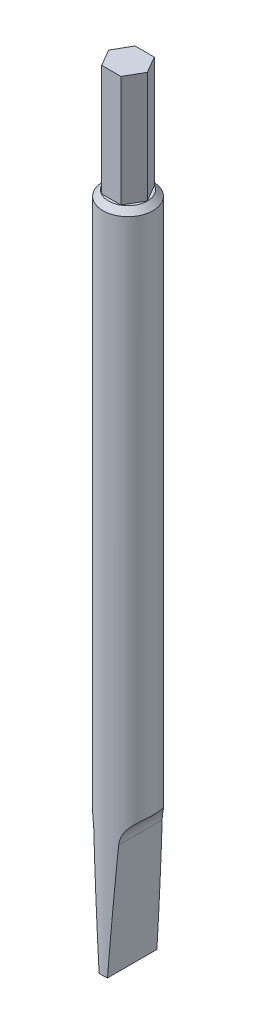
ISO-10303-21;
HEADER;
FILE_DESCRIPTION(('STEP AP214'),'2;1');
FILE_NAME('part.step','',(''),(''),'','','');
FILE_SCHEMA(('AUTOMOTIVE_DESIGN { 1 0 10303 214 1 1 1 1 }'));
ENDSEC;
DATA;
#1=APPLICATION_CONTEXT('core data for automotive mechanical design processes');
#2=APPLICATION_PROTOCOL_DEFINITION('international standard','automotive_design',2000,#1);
#3=PRODUCT_CONTEXT('',#1,'mechanical');
#4=PRODUCT('Part','Part','',(#3));
#5=PRODUCT_RELATED_PRODUCT_CATEGORY('part','',(#4));
#6=PRODUCT_DEFINITION_FORMATION('','',#4);
#7=PRODUCT_DEFINITION_CONTEXT('part definition',#1,'design');
#8=PRODUCT_DEFINITION('design','',#6,#7);
#9=PRODUCT_DEFINITION_SHAPE('','',#8);
#10=(LENGTH_UNIT() NAMED_UNIT(*) SI_UNIT(.MILLI.,.METRE.));
#11=(NAMED_UNIT(*) PLANE_ANGLE_UNIT() SI_UNIT($,.RADIAN.));
#12=(NAMED_UNIT(*) SI_UNIT($,.STERADIAN.) SOLID_ANGLE_UNIT());
#13=UNCERTAINTY_MEASURE_WITH_UNIT(LENGTH_MEASURE(1.E-05),#10,'distance_accuracy_value','');
#14=(GEOMETRIC_REPRESENTATION_CONTEXT(3) GLOBAL_UNCERTAINTY_ASSIGNED_CONTEXT((#13)) GLOBAL_UNIT_ASSIGNED_CONTEXT((#10,
#11,#12)) REPRESENTATION_CONTEXT('',''));
#15=CARTESIAN_POINT('',(0.,0.,0.));
#16=DIRECTION('',(0.,0.,1.));
#17=DIRECTION('',(1.,0.,0.));
#18=AXIS2_PLACEMENT_3D('',#15,#16,#17);
#19=CARTESIAN_POINT('',(0.,120.,0.));
#20=DIRECTION('',(0.,-1.,0.));
#21=DIRECTION('',(0.,0.,-1.));
#22=AXIS2_PLACEMENT_3D('',#19,#20,#21);
#23=CYLINDRICAL_SURFACE('',#22,4.5);
#24=CARTESIAN_POINT('',(0.,119.,0.));
#25=DIRECTION('',(0.,1.,0.));
#26=DIRECTION('',(0.,0.,1.));
#27=AXIS2_PLACEMENT_3D('',#24,#25,#26);
#28=CIRCLE('',#27,4.5);
#29=CARTESIAN_POINT('',(0.,119.,4.5));
#30=VERTEX_POINT('',#29);
#31=EDGE_CURVE('E195',#30,#30,#28,.F.);
#32=ORIENTED_EDGE('',*,*,#31,.T.);
#33=EDGE_LOOP('',(#32));
#34=FACE_BOUND('',#33,.T.);
#35=CARTESIAN_POINT('',(4.5,25.,0.));
#36=CARTESIAN_POINT('',(4.49999959992725,25.0000002197825,-0.103069362665923));
#37=CARTESIAN_POINT('',(4.4964547687701,24.9977117883437,-0.206146526435712));
#38=CARTESIAN_POINT('',(4.48231641289706,24.9885094011417,-0.411646375812205));
#39=CARTESIAN_POINT('',(4.471720103098,24.9815936177332,-0.514068786670952));
#40=CARTESIAN_POINT('',(4.44359339520637,24.9629816995036,-0.717671951158926));
#41=CARTESIAN_POINT('',(4.42605305791933,24.9512787118113,-0.818850709741652));
#42=CARTESIAN_POINT('',(4.38426815019585,24.9228626325524,-1.01914825963944));
#43=CARTESIAN_POINT('',(4.36002062815834,24.9061473349679,-1.11826612333105));
#44=CARTESIAN_POINT('',(4.30514220860286,24.8673923480396,-1.31380152114607));
#45=CARTESIAN_POINT('',(4.27450302221004,24.8453457389448,-1.41021536260286));
#46=CARTESIAN_POINT('',(4.20736148164584,24.7956160536421,-1.59943155048248));
#47=CARTESIAN_POINT('',(4.17086194222075,24.767935681649,-1.69223560424763));
#48=CARTESIAN_POINT('',(4.09264183349527,24.7066046140397,-1.87350490130667));
#49=CARTESIAN_POINT('',(4.05092440102978,24.6729575004078,-1.96197270731234));
#50=CARTESIAN_POINT('',(3.96303382328751,24.5993661271413,-2.13393666412593));
#51=CARTESIAN_POINT('',(3.91686087963601,24.5594221524068,-2.21743303962979));
#52=CARTESIAN_POINT('',(3.82239737029962,24.4742608955362,-2.37646391449525));
#53=CARTESIAN_POINT('',(3.77420859180666,24.4292325735824,-2.45216008078264));
#54=CARTESIAN_POINT('',(3.67546318239439,24.3328732662188,-2.59782907350368));
#55=CARTESIAN_POINT('',(3.62490574033656,24.2815401118433,-2.66779991646167));
#56=CARTESIAN_POINT('',(3.52252047999784,24.1726173143242,-2.80159661560525));
#57=CARTESIAN_POINT('',(3.47069333419624,24.1150309299113,-2.86542564006081));
#58=CARTESIAN_POINT('',(3.36681443417587,23.9937009585887,-2.98679509415646));
#59=CARTESIAN_POINT('',(3.31476260433588,23.9299551141531,-3.04433320149472));
#60=CARTESIAN_POINT('',(3.21343160285213,23.7990606139254,-3.15104312227083));
#61=CARTESIAN_POINT('',(3.16412086929093,23.7321233651335,-3.20044482157965));
#62=CARTESIAN_POINT('',(3.06719777608159,23.5931418020546,-3.29344984525706));
#63=CARTESIAN_POINT('',(3.01958602561713,23.5210956830591,-3.33705110482005));
#64=CARTESIAN_POINT('',(2.92690525303493,23.3723530558154,-3.41863105708231));
#65=CARTESIAN_POINT('',(2.8818360138848,23.2956569456601,-3.45661023014176));
#66=CARTESIAN_POINT('',(2.79493487388616,23.1380591403335,-3.52724775030432));
#67=CARTESIAN_POINT('',(2.75310417130193,23.0571559068526,-3.55990413285861));
#68=CARTESIAN_POINT('',(2.67102432402597,22.8869517854436,-3.62193674409111));
#69=CARTESIAN_POINT('',(2.63100129171946,22.7974350930536,-3.65101984206153));
#70=CARTESIAN_POINT('',(2.55582789107762,22.6148580591291,-3.7040330490454));
#71=CARTESIAN_POINT('',(2.52067963573703,22.5217962030663,-3.72796092597584));
#72=CARTESIAN_POINT('',(2.45572257370377,22.3327438863957,-3.77106708250035));
#73=CARTESIAN_POINT('',(2.42591450554497,22.2367530228588,-3.79024470528685));
#74=CARTESIAN_POINT('',(2.371985126562,22.0424260431399,-3.82422567164936));
#75=CARTESIAN_POINT('',(2.34786427600567,21.9440897378494,-3.83902866120985));
#76=CARTESIAN_POINT('',(2.30317872247504,21.7344392115953,-3.86602211295916));
#77=CARTESIAN_POINT('',(2.2833212295114,21.6229114451606,-3.87773008241695));
#78=CARTESIAN_POINT('',(2.25119824829117,21.3983776429027,-3.89646653880564));
#79=CARTESIAN_POINT('',(2.23893326853474,21.2853715085848,-3.90349471231479));
#80=CARTESIAN_POINT('',(2.2221278006484,21.0585475614571,-3.9130860068678));
#81=CARTESIAN_POINT('',(2.21759074245094,20.9447294107383,-3.91564714529122));
#82=CARTESIAN_POINT('',(2.21629990204796,20.7170357567943,-3.9163777367708));
#83=CARTESIAN_POINT('',(2.21954621021972,20.6031602529186,-3.9145471388319));
#84=CARTESIAN_POINT('',(2.23426894804853,20.3683979068717,-3.90616454068513));
#85=CARTESIAN_POINT('',(2.24628494335067,20.247555384675,-3.89930286209516));
#86=CARTESIAN_POINT('',(2.2789980246609,20.0074652157646,-3.88027386542346));
#87=CARTESIAN_POINT('',(2.29969560002872,19.8882176593464,-3.86810624825724));
#88=CARTESIAN_POINT('',(2.34949827973738,19.6522008537151,-3.83805987169653));
#89=CARTESIAN_POINT('',(2.37860449941632,19.5354319354802,-3.82018035463177));
#90=CARTESIAN_POINT('',(2.44479279662183,19.3053270220365,-3.77816410484999));
#91=CARTESIAN_POINT('',(2.48187454180607,19.1919908840073,-3.75402763285339));
#92=CARTESIAN_POINT('',(2.56264818514399,18.9717596235569,-3.6993468607103));
#93=CARTESIAN_POINT('',(2.60620662438002,18.8647845641702,-3.66892797534513));
#94=CARTESIAN_POINT('',(2.69961396127203,18.6560306378224,-3.60075344227851));
#95=CARTESIAN_POINT('',(2.74946286078548,18.5542517723957,-3.56299779241061));
#96=CARTESIAN_POINT('',(2.85434660668727,18.3569550826022,-3.47953864440165));
#97=CARTESIAN_POINT('',(2.90937580002357,18.2614306217757,-3.43384376500395));
#98=CARTESIAN_POINT('',(3.02335500686727,18.0774413157122,-3.3339258219214));
#99=CARTESIAN_POINT('',(3.08230445292271,17.9889754528119,-3.27970399095881));
#100=CARTESIAN_POINT('',(3.19631152006896,17.8286907859084,-3.16847855957585));
#101=CARTESIAN_POINT('',(3.25113633589682,17.7560975257227,-3.11235065569654));
#102=CARTESIAN_POINT('',(3.36143714975015,17.6176556877435,-2.99288250161539));
#103=CARTESIAN_POINT('',(3.41691308679794,17.5518064838969,-2.92954292203083));
#104=CARTESIAN_POINT('',(3.52719038039944,17.4271575897072,-2.79578912411175));
#105=CARTESIAN_POINT('',(3.58199193718975,17.3683557592146,-2.72537706555113));
#106=CARTESIAN_POINT('',(3.68963122609968,17.2578891525056,-2.57778204696872));
#107=CARTESIAN_POINT('',(3.74246904856555,17.2062240476495,-2.50059939899425));
#108=CARTESIAN_POINT('',(3.84035365857382,17.1142819735882,-2.34717040047752));
#109=CARTESIAN_POINT('',(3.88567430027106,17.0733993624697,-2.27146003882036));
#110=CARTESIAN_POINT('',(3.972848583273,16.9973221337187,-2.11529480833383));
#111=CARTESIAN_POINT('',(4.0147011181452,16.962129327929,-2.03483843928944));
#112=CARTESIAN_POINT('',(4.09418737623395,16.8972238494773,-1.86976491901818));
#113=CARTESIAN_POINT('',(4.13182186181072,16.8675101858996,-1.78514852365475));
#114=CARTESIAN_POINT('',(4.20228834208165,16.813269199536,-1.6122927357632));
#115=CARTESIAN_POINT('',(4.23511849285271,16.7887438664514,-1.52405196874021));
#116=CARTESIAN_POINT('',(4.29601076944073,16.7442109434331,-1.34297373485953));
#117=CARTESIAN_POINT('',(4.32397708815631,16.7242920251056,-1.25008227473878));
#118=CARTESIAN_POINT('',(4.37402031006423,16.6892514817669,-1.0618089991616));
#119=CARTESIAN_POINT('',(4.39609519434713,16.6741315009471,-0.966426342269647));
#120=CARTESIAN_POINT('',(4.43405247530582,16.6484511370493,-0.773829999084722));
#121=CARTESIAN_POINT('',(4.44993460419531,16.6378909511433,-0.676616233801714));
#122=CARTESIAN_POINT('',(4.47530827628885,16.6211440963123,-0.480984528317151));
#123=CARTESIAN_POINT('',(4.48479958348029,16.6149575889066,-0.382566543780505));
#124=CARTESIAN_POINT('',(4.49761588849471,16.6066227549277,-0.179786485951482));
#125=CARTESIAN_POINT('',(4.50057852937734,16.6047116422493,-0.0753915311064947));
#126=CARTESIAN_POINT('',(4.49923517876634,16.6055812949774,0.133298519520398));
#127=CARTESIAN_POINT('',(4.49493142161667,16.6083606181221,0.237593636135413));
#128=CARTESIAN_POINT('',(4.47911096934641,16.6186702343469,0.445460657929826));
#129=CARTESIAN_POINT('',(4.46759016111325,16.6262032366426,0.549032116626802));
#130=CARTESIAN_POINT('',(4.43749130505876,16.6461735855517,0.754625845668829));
#131=CARTESIAN_POINT('',(4.41891599361709,16.6586090306217,0.856648700766103));
#132=CARTESIAN_POINT('',(4.3746424375622,16.6888464556667,1.05994525916554));
#133=CARTESIAN_POINT('',(4.34884294710629,16.7067250567804,1.16118558801716));
#134=CARTESIAN_POINT('',(4.29065419495021,16.7480933097216,1.36053785732147));
#135=CARTESIAN_POINT('',(4.2582675382252,16.7715807441048,1.45865101676466));
#136=CARTESIAN_POINT('',(4.18745032243508,16.8245285691193,1.65098719675716));
#137=CARTESIAN_POINT('',(4.14902108003093,16.8539876589484,1.74521105913875));
#138=CARTESIAN_POINT('',(4.06681991059838,16.9192496912752,1.92901767855518));
#139=CARTESIAN_POINT('',(4.02304826739616,16.9550522968059,2.01860068178547));
#140=CARTESIAN_POINT('',(3.93288020236327,17.0317602466168,2.18891848545425));
#141=CARTESIAN_POINT('',(3.88665900252031,17.0724039420428,2.2698639349504));
#142=CARTESIAN_POINT('',(3.79099688495646,17.1600665291389,2.42626213602189));
#143=CARTESIAN_POINT('',(3.74155488053636,17.2070875783783,2.50171301535398));
#144=CARTESIAN_POINT('',(3.64053705577675,17.3075542985464,2.64656035017943));
#145=CARTESIAN_POINT('',(3.58896292015322,17.3609949582933,2.71596145605909));
#146=CARTESIAN_POINT('',(3.48473261347848,17.474313349933,2.84846407594613));
#147=CARTESIAN_POINT('',(3.43207606161792,17.5341933797583,2.91156332549745));
#148=CARTESIAN_POINT('',(3.32934266894438,17.6571844484924,3.02840560019249));
#149=CARTESIAN_POINT('',(3.27926236791103,17.7200059188053,3.08245105089513));
#150=CARTESIAN_POINT('',(3.18010490670166,17.8510485347542,3.18465150256468));
#151=CARTESIAN_POINT('',(3.13102810746447,17.919271581688,3.23280441410219));
#152=CARTESIAN_POINT('',(3.03479657993718,18.0607153565325,3.32330769017292));
#153=CARTESIAN_POINT('',(2.98764162398131,18.1339354897128,3.36565874341879));
#154=CARTESIAN_POINT('',(2.89603178121556,18.2849640418223,3.44480286097595));
#155=CARTESIAN_POINT('',(2.85157789787664,18.3627741450609,3.48159386714152));
#156=CARTESIAN_POINT('',(2.76448915105963,18.5254453724791,3.55117195899449));
#157=CARTESIAN_POINT('',(2.7219835871284,18.6104611461558,3.58375903483153));
#158=CARTESIAN_POINT('',(2.64126927684473,18.7843466310612,3.64365535207884));
#159=CARTESIAN_POINT('',(2.60306237477838,18.8732179739868,3.67096233171438));
#160=CARTESIAN_POINT('',(2.53147847510343,19.054222105154,3.72068770710746));
#161=CARTESIAN_POINT('',(2.49810205171687,19.1463552795277,3.74310552182694));
#162=CARTESIAN_POINT('',(2.43658605030678,19.3333184956038,3.78343773102366));
#163=CARTESIAN_POINT('',(2.40844692584047,19.4281487700598,3.80135173551188));
#164=CARTESIAN_POINT('',(2.35490834516223,19.6305729144311,3.83477673953591));
#165=CARTESIAN_POINT('',(2.33015598307192,19.7384185508764,3.84980292215984));
#166=CARTESIAN_POINT('',(2.28779373167278,19.9560506990995,3.87512687895667));
#167=CARTESIAN_POINT('',(2.27018429768784,20.0658373341405,3.88542435170484));
#168=CARTESIAN_POINT('',(2.24229877350844,20.2867078146914,3.90158383710492));
#169=CARTESIAN_POINT('',(2.23202579654068,20.3977921906002,3.90744396683314));
#170=CARTESIAN_POINT('',(2.2189329942526,20.620541373334,3.91489365328983));
#171=CARTESIAN_POINT('',(2.21611336057867,20.7322061950101,3.91648310020707));
#172=CARTESIAN_POINT('',(2.21803256126056,20.9645298748976,3.91539728764433));
#173=CARTESIAN_POINT('',(2.2234039770138,21.0851825167372,3.9123651171464));
#174=CARTESIAN_POINT('',(2.24283296683402,21.3255598032933,3.9012593658522));
#175=CARTESIAN_POINT('',(2.25689107423433,21.4452843905735,3.89318547551113));
#176=CARTESIAN_POINT('',(2.29352339709321,21.6829806364795,3.87171813877961));
#177=CARTESIAN_POINT('',(2.31610006161069,21.8009517808485,3.85832316253482));
#178=CARTESIAN_POINT('',(2.36946433582885,22.0342166902461,3.82578291934212));
#179=CARTESIAN_POINT('',(2.40025175186695,22.1495105183533,3.8066377880187));
#180=CARTESIAN_POINT('',(2.46955006626093,22.3764107111197,3.76204969756656));
#181=CARTESIAN_POINT('',(2.50805494617877,22.488019870747,3.73661164235412));
#182=CARTESIAN_POINT('',(2.59215244599265,22.7066840292833,3.6787699767713));
#183=CARTESIAN_POINT('',(2.63774518011544,22.8137389547615,3.64636625414009));
#184=CARTESIAN_POINT('',(2.73508968205904,23.0222075358242,3.57392775310544));
#185=CARTESIAN_POINT('',(2.78683582239651,23.1236262232294,3.53389992732547));
#186=CARTESIAN_POINT('',(2.89537198598165,23.3199368856706,3.4455351808607));
#187=CARTESIAN_POINT('',(2.95216132870909,23.4148297382334,3.39719938041741));
#188=CARTESIAN_POINT('',(3.06401792825743,23.5888613984574,3.29650209378133));
#189=CARTESIAN_POINT('',(3.11877030223411,23.6686477820911,3.24490917812634));
#190=CARTESIAN_POINT('',(3.23002452467415,23.8214891985089,3.13418199914556));
#191=CARTESIAN_POINT('',(3.28652626330706,23.8945446527409,3.07504820853485));
#192=CARTESIAN_POINT('',(3.39987656193094,24.0334302131299,2.94923741426076));
#193=CARTESIAN_POINT('',(3.45672486934676,24.0992650403017,2.88256539788781));
#194=CARTESIAN_POINT('',(3.56938382220596,24.2234953095027,2.74182760560056));
#195=CARTESIAN_POINT('',(3.62519454533971,24.2818913104546,2.66776238592769));
#196=CARTESIAN_POINT('',(3.72868896674217,24.3854775849313,2.52073395305748));
#197=CARTESIAN_POINT('',(3.77661337954485,24.4314098963345,2.44846069234197));
#198=CARTESIAN_POINT('',(3.86959754692028,24.5173527843578,2.29869197722838));
#199=CARTESIAN_POINT('',(3.91465631003365,24.5573613177553,2.22119473433099));
#200=CARTESIAN_POINT('',(4.00106138832014,24.6316232898957,2.06149289386532));
#201=CARTESIAN_POINT('',(4.04240685362276,24.6658754127114,1.97928722568458));
#202=CARTESIAN_POINT('',(4.1206688840926,24.7288766689265,1.81072524154589));
#203=CARTESIAN_POINT('',(4.15758383993656,24.7576238049575,1.72436743323572));
#204=CARTESIAN_POINT('',(4.22635764730017,24.8098777553719,1.54817364969427));
#205=CARTESIAN_POINT('',(4.25821859353252,24.8333867424307,1.45833913474397));
#206=CARTESIAN_POINT('',(4.3164428873989,24.8754834818024,1.27573849578303));
#207=CARTESIAN_POINT('',(4.34280376836452,24.8940690270541,1.1829710778091));
#208=CARTESIAN_POINT('',(4.38960691636663,24.9265486522779,0.995331853000653));
#209=CARTESIAN_POINT('',(4.41005951223732,24.9404509266789,0.900464034630373));
#210=CARTESIAN_POINT('',(4.44484740959923,24.9638359869689,0.709077330364528));
#211=CARTESIAN_POINT('',(4.4591828016397,24.9733188382763,0.612558468930346));
#212=CARTESIAN_POINT('',(4.48021987851915,24.9871470558806,0.430138417632385));
#213=CARTESIAN_POINT('',(4.48763162485991,24.9919726718831,0.344354315724885));
#214=CARTESIAN_POINT('',(4.49752188615395,24.9983990737922,0.172381964724905));
#215=CARTESIAN_POINT('',(4.50000033456842,24.9999998162027,0.0861937101970542));
#216=CARTESIAN_POINT('',(4.5,25.,0.));
#217=B_SPLINE_CURVE_WITH_KNOTS('',3,(#35,#36,#37,#38,#39,#40,#41,#42,#43,#44,#45,#46,#47,#48,
#49,#50,#51,#52,#53,#54,#55,#56,#57,#58,#59,#60,#61,#62,#63,#64,#65,#66,#67,#68,#69,#70,#71,#72,
#73,#74,#75,#76,#77,#78,#79,#80,#81,#82,#83,#84,#85,#86,#87,#88,#89,#90,#91,#92,#93,#94,#95,#96,
#97,#98,#99,#100,#101,#102,#103,#104,#105,#106,#107,#108,#109,#110,#111,#112,#113,#114,#115,
#116,#117,#118,#119,#120,#121,#122,#123,#124,#125,#126,#127,#128,#129,#130,#131,#132,#133,#134,
#135,#136,#137,#138,#139,#140,#141,#142,#143,#144,#145,#146,#147,#148,#149,#150,#151,#152,#153,
#154,#155,#156,#157,#158,#159,#160,#161,#162,#163,#164,#165,#166,#167,#168,#169,#170,#171,#172,
#173,#174,#175,#176,#177,#178,#179,#180,#181,#182,#183,#184,#185,#186,#187,#188,#189,#190,#191,
#192,#193,#194,#195,#196,#197,#198,#199,#200,#201,#202,#203,#204,#205,#206,#207,#208,#209,#210,
#211,#212,#213,#214,#215,#216),.UNSPECIFIED.,.T.,.F.,(4,2,2,2,2,2,2,2,2,2,2,2,2,2,2,2,2,2,2,2,2,
2,2,2,2,2,2,2,2,2,2,2,2,2,2,2,2,2,2,2,2,2,2,2,2,2,2,2,2,2,2,2,2,2,2,2,2,2,2,2,2,2,2,2,2,2,2,2,2,
2,2,2,2,2,2,2,2,2,2,2,2,2,2,2,2,2,2,2,2,2,4),(0.,0.309135188173822,0.61839254627253,
0.928094163427286,1.23793228701997,1.54817474269632,1.85826863124844,2.16817698902182,
2.47807132908082,2.77887922218734,3.07979088952104,3.38054648928678,3.6814127412398,
3.97121245448043,4.26111505440181,4.55099287026079,4.84097743386245,5.147493657908,
5.45414233035836,5.76083337883226,6.06754923936998,6.40883423722361,6.75014208978928,
7.09160138774855,7.43306465061267,7.79752512639503,8.16200614869652,8.52653553864863,
8.89104974150326,9.2488899118394,9.60673018784066,9.96418439614748,10.3215869755265,
10.6418214865779,10.9620262431482,11.2821335120663,11.6022260354161,11.893632150727,
12.1851308784472,12.4765768361295,12.7681343602163,13.0649078374311,13.3617828844209,
13.6586707674181,13.9555696138638,14.2685711441521,14.5814764471602,14.894560242336,
15.2075227188972,15.5251120490118,15.842576027905,16.159970927982,16.4773489731259,
16.7820217341375,17.0867978295395,17.3913375424989,17.6959862954218,17.9861303984156,
18.2763770870127,18.5665892918135,18.856908661828,19.1580344208093,19.4592888852298,
19.7605791318425,20.0618954584726,20.3965333004211,20.7311924704109,21.0659935688243,
21.4008032758306,21.762809667809,22.1248382879576,22.4869710696219,22.84909531061,
23.2109382414062,23.5727870042114,23.9343073537813,24.2957789943863,24.6243013724941,
24.9528031666233,25.2810888818576,25.6093499164933,25.903392228367,26.1975357258831,
26.4917463740058,26.7860635688321,27.080258458796,27.3745850069726,27.6683938572329,
27.9621983582687,28.2207150382293,28.4792352049594),.UNSPECIFIED.);
#218=CARTESIAN_POINT('',(2.22904475760722,21.1513254572824,3.90913794443018));
#219=VERTEX_POINT('',#218);
#220=CARTESIAN_POINT('',(2.22904475760722,21.1513254572824,-3.90913794443018));
#221=VERTEX_POINT('',#220);
#222=EDGE_CURVE('E11',#219,#221,#217,.T.);
#223=ORIENTED_EDGE('',*,*,#222,.T.);
#224=CARTESIAN_POINT('',(0.,-10.7254996925351,0.));
#225=DIRECTION('',(-0.997564050259825,0.0697564737441181,0.));
#226=DIRECTION('',(-0.0697564737441181,-0.997564050259825,0.));
#227=AXIS2_PLACEMENT_3D('',#224,#225,#226);
#228=ELLIPSE('',#227,64.5101416179232,4.5);
#229=CARTESIAN_POINT('',(0.75,0.,-4.43705983732471));
#230=VERTEX_POINT('',#229);
#231=EDGE_CURVE('E135',#221,#230,#228,.T.);
#232=ORIENTED_EDGE('',*,*,#231,.T.);
#233=CARTESIAN_POINT('',(0.,0.,0.));
#234=DIRECTION('',(0.,1.,0.));
#235=DIRECTION('',(0.,0.,1.));
#236=AXIS2_PLACEMENT_3D('',#233,#234,#235);
#237=CIRCLE('',#236,4.5);
#238=CARTESIAN_POINT('',(-0.75,0.,-4.43705983732471));
#239=VERTEX_POINT('',#238);
#240=EDGE_CURVE('E134',#230,#239,#237,.T.);
#241=ORIENTED_EDGE('',*,*,#240,.T.);
#242=CARTESIAN_POINT('',(0.,-10.7254996925351,0.));
#243=DIRECTION('',(0.997564050259825,0.0697564737441181,0.));
#244=DIRECTION('',(0.0697564737441181,-0.997564050259825,0.));
#245=AXIS2_PLACEMENT_3D('',#242,#243,#244);
#246=ELLIPSE('',#245,64.5101416179232,4.5);
#247=CARTESIAN_POINT('',(-2.22904475760722,21.1513254572824,-3.90913794443018));
#248=VERTEX_POINT('',#247);
#249=EDGE_CURVE('E59',#239,#248,#246,.T.);
#250=ORIENTED_EDGE('',*,*,#249,.T.);
#251=CARTESIAN_POINT('',(-2.21686500890634,20.8025430885618,-3.91605790716719));
#252=CARTESIAN_POINT('',(-2.21686541766622,20.9197791961003,-3.91605827017623));
#253=CARTESIAN_POINT('',(-2.2209925846671,21.0370230483852,-3.91373006399613));
#254=CARTESIAN_POINT('',(-2.23745885695756,21.2707845035446,-3.90433943824787));
#255=CARTESIAN_POINT('',(-2.24980110333789,21.3873018114126,-3.89727520782157));
#256=CARTESIAN_POINT('',(-2.2825857573446,21.6189994556137,-3.87816493182726));
#257=CARTESIAN_POINT('',(-2.30304281179426,21.7341769846356,-3.86610987634112));
#258=CARTESIAN_POINT('',(-2.35179738039968,21.9621561360079,-3.83664695386146));
#259=CARTESIAN_POINT('',(-2.38009410662444,22.0749579959011,-3.81923962478216));
#260=CARTESIAN_POINT('',(-2.4442296688225,22.2976743449524,-3.77851663077295));
#261=CARTESIAN_POINT('',(-2.48008995910786,22.4075795983199,-3.75518411961044));
#262=CARTESIAN_POINT('',(-2.55874359161576,22.6232795386732,-3.70203764512981));
#263=CARTESIAN_POINT('',(-2.60153716653428,22.7290740875471,-3.6722234642614));
#264=CARTESIAN_POINT('',(-2.69324396809013,22.9355210904624,-3.6055023305279));
#265=CARTESIAN_POINT('',(-2.74215063857545,23.03617889307,-3.56860295397224));
#266=CARTESIAN_POINT('',(-2.84512289666302,23.2315468479444,-3.48705962629283));
#267=CARTESIAN_POINT('',(-2.89918797360655,23.3262575874075,-3.44241644141361));
#268=CARTESIAN_POINT('',(-3.00780363442481,23.5032687084169,-3.34783180347566));
#269=CARTESIAN_POINT('',(-3.06212216063817,23.5859738528299,-3.29838158116178));
#270=CARTESIAN_POINT('',(-3.17299064561675,23.7447280832125,-3.19187020868205));
#271=CARTESIAN_POINT('',(-3.22954051678943,23.8207774300823,-3.13480935706631));
#272=CARTESIAN_POINT('',(-3.34347375812188,23.9656636154185,-3.01299377471531));
#273=CARTESIAN_POINT('',(-3.40085664221116,24.0345044815718,-2.94824338408676));
#274=CARTESIAN_POINT('',(-3.51503697750078,24.1646802612962,-2.81113292283731));
#275=CARTESIAN_POINT('',(-3.57183447979562,24.2260158351287,-2.73877352264501));
#276=CARTESIAN_POINT('',(-3.67742371266402,24.3348906965177,-2.594926564046));
#277=CARTESIAN_POINT('',(-3.72642185716799,24.3832039442328,-2.52417391137116));
#278=CARTESIAN_POINT('',(-3.82183927812729,24.4738004806719,-2.37722934011018));
#279=CARTESIAN_POINT('',(-3.86825767469528,24.5160817196407,-2.30103558570223));
#280=CARTESIAN_POINT('',(-3.95759602937442,24.5947336440028,-2.1437381771174));
#281=CARTESIAN_POINT('',(-4.00051676448572,24.6311056439182,-2.06263562043841));
#282=CARTESIAN_POINT('',(-4.0821144286683,24.6981985340299,-1.89603498936593));
#283=CARTESIAN_POINT('',(-4.12078972510703,24.7289172532424,-1.81053524241446));
#284=CARTESIAN_POINT('',(-4.19286443062665,24.784687851772,-1.63666006222785));
#285=CARTESIAN_POINT('',(-4.22631312895881,24.8097937742375,-1.5483223420763));
#286=CARTESIAN_POINT('',(-4.28790370776765,24.8550296009389,-1.36854441158787));
#287=CARTESIAN_POINT('',(-4.3160438034068,24.8751578322997,-1.27710316994615));
#288=CARTESIAN_POINT('',(-4.36661021060377,24.9107061080983,-1.09176138401926));
#289=CARTESIAN_POINT('',(-4.3890365199872,24.9261261507444,-0.997860838798201));
#290=CARTESIAN_POINT('',(-4.42788562300572,24.9525003386506,-0.808207799024175));
#291=CARTESIAN_POINT('',(-4.44430814374339,24.9634542809103,-0.712455220496748));
#292=CARTESIAN_POINT('',(-4.47167931577288,24.9815670281087,-0.51440908040303));
#293=CARTESIAN_POINT('',(-4.48227813127865,24.9884845864785,-0.412044921364492));
#294=CARTESIAN_POINT('',(-4.4964304941887,24.9976958873334,-0.206656476139785));
#295=CARTESIAN_POINT('',(-4.499986102108,24.9999909821395,-0.103632391868348));
#296=CARTESIAN_POINT('',(-4.50001382442758,25.000008970397,0.102480944772165));
#297=CARTESIAN_POINT('',(-4.49648159554806,24.9977290603801,0.205570198378079));
#298=CARTESIAN_POINT('',(-4.48237220204938,24.9885459001404,0.411020818892741));
#299=CARTESIAN_POINT('',(-4.47179758297248,24.9816443204614,0.513382435306361));
#300=CARTESIAN_POINT('',(-4.44333220259527,24.9628094439688,0.719690877117496));
#301=CARTESIAN_POINT('',(-4.42523688640041,24.9507351471167,0.823596752421451));
#302=CARTESIAN_POINT('',(-4.38199900826083,24.9213071738719,1.02912985931436));
#303=CARTESIAN_POINT('',(-4.35685918697571,24.9039555503955,1.13075796049651));
#304=CARTESIAN_POINT('',(-4.29991684009891,24.8636549062588,1.33099524111142));
#305=CARTESIAN_POINT('',(-4.26811442394671,24.8407059775385,1.42960447010156));
#306=CARTESIAN_POINT('',(-4.19837892756046,24.7888481924937,1.62301576979504));
#307=CARTESIAN_POINT('',(-4.16044609588461,24.7599395777919,1.71781799465921));
#308=CARTESIAN_POINT('',(-4.08020609205683,24.6966298314282,1.90042169778344));
#309=CARTESIAN_POINT('',(-4.03803919274113,24.6623920363143,1.98834139983806));
#310=CARTESIAN_POINT('',(-3.94934343458317,24.5876012901743,2.15915408114585));
#311=CARTESIAN_POINT('',(-3.90281466727466,24.547048471657,2.24204716582243));
#312=CARTESIAN_POINT('',(-3.80636505987929,24.4594175357688,2.40214791366492));
#313=CARTESIAN_POINT('',(-3.75644610156529,24.412343023506,2.47935868208088));
#314=CARTESIAN_POINT('',(-3.65426373430086,24.311534309895,2.62763453596879));
#315=CARTESIAN_POINT('',(-3.60200043433577,24.2578004179284,2.69869990668336));
#316=CARTESIAN_POINT('',(-3.49918810305908,24.1468338129261,2.83059871182415));
#317=CARTESIAN_POINT('',(-3.44870231957637,24.0899547636843,2.89177959051548));
#318=CARTESIAN_POINT('',(-3.34765466908196,23.9704031517152,3.00818072172664));
#319=CARTESIAN_POINT('',(-3.29709278166574,23.9077285738948,3.06339888644746));
#320=CARTESIAN_POINT('',(-3.19691004033947,23.7768914716248,3.16780704395007));
#321=CARTESIAN_POINT('',(-3.1472889525772,23.7087303336515,3.21699855181767));
#322=CARTESIAN_POINT('',(-3.04987968205233,23.5672514149568,3.30949368510652));
#323=CARTESIAN_POINT('',(-3.00209222022971,23.4939316374398,3.35279501133232));
#324=CARTESIAN_POINT('',(-2.90882323607785,23.3419893176549,3.43403626318864));
#325=CARTESIAN_POINT('',(-2.86336372381262,23.2633283713799,3.47192953365514));
#326=CARTESIAN_POINT('',(-2.77589326205877,23.1017204203835,3.54225471335156));
#327=CARTESIAN_POINT('',(-2.7338837758531,23.0187716210821,3.5746843113061));
#328=CARTESIAN_POINT('',(-2.65394685821971,22.8491427650396,3.63442666431271));
#329=CARTESIAN_POINT('',(-2.6160198316815,22.7624623393951,3.66173891203569));
#330=CARTESIAN_POINT('',(-2.54474884868801,22.58590956483,3.71162305042929));
#331=CARTESIAN_POINT('',(-2.51140531305344,22.4960369237768,3.73419450593732));
#332=CARTESIAN_POINT('',(-2.44660926503083,22.3045006035052,3.77700417287939));
#333=CARTESIAN_POINT('',(-2.41567983006214,22.2025569370456,3.79678291359226));
#334=CARTESIAN_POINT('',(-2.36025150935203,21.9961608035249,3.83148555585085));
#335=CARTESIAN_POINT('',(-2.33575111873876,21.8917089298292,3.84641059371809));
#336=CARTESIAN_POINT('',(-2.2934364831337,21.680849743195,3.87179011310006));
#337=CARTESIAN_POINT('',(-2.27562692278727,21.5744411146932,3.88224146303264));
#338=CARTESIAN_POINT('',(-2.24691046116911,21.36040465515,3.89893168831572));
#339=CARTESIAN_POINT('',(-2.23600163226888,21.2527771731378,3.90517174006953));
#340=CARTESIAN_POINT('',(-2.22046061937399,21.026282431352,3.91403189610526));
#341=CARTESIAN_POINT('',(-2.21654946401933,20.9073486752023,3.91623665476216));
#342=CARTESIAN_POINT('',(-2.21722039992247,20.6695077081623,3.91585660269446));
#343=CARTESIAN_POINT('',(-2.22180305496502,20.5506004995581,3.91327147403655));
#344=CARTESIAN_POINT('',(-2.2394126712855,20.3135682017387,3.9032209774479));
#345=CARTESIAN_POINT('',(-2.25244312745377,20.1954434566733,3.89575358969548));
#346=CARTESIAN_POINT('',(-2.28679431030814,19.960844396551,3.87568922895946));
#347=CARTESIAN_POINT('',(-2.30811501249953,19.8443700766186,3.8630922711319));
#348=CARTESIAN_POINT('',(-2.35937032021611,19.6111876873243,3.83200884516043));
#349=CARTESIAN_POINT('',(-2.38949660587773,19.4945391577763,3.81339021487952));
#350=CARTESIAN_POINT('',(-2.45769634583543,19.2647945564248,3.76979648260776));
#351=CARTESIAN_POINT('',(-2.49577007357865,19.1516986070088,3.74482116189616));
#352=CARTESIAN_POINT('',(-2.57919229508474,18.9301123756363,3.68786051829598));
#353=CARTESIAN_POINT('',(-2.62453664467306,18.8216195142558,3.65587918497697));
#354=CARTESIAN_POINT('',(-2.72163058790187,18.6101942507803,3.58418268803467));
#355=CARTESIAN_POINT('',(-2.77337950267297,18.5072612610101,3.54446834383762));
#356=CARTESIAN_POINT('',(-2.87842569948365,18.3147447752878,3.45961054822487));
#357=CARTESIAN_POINT('',(-2.93137819958391,18.2247294915366,3.41502017503047));
#358=CARTESIAN_POINT('',(-3.04068506699077,18.0511732780349,3.31806680957836));
#359=CARTESIAN_POINT('',(-3.09703927898884,17.9676320531018,3.26570417201212));
#360=CARTESIAN_POINT('',(-3.21174165215523,17.8077712558874,3.15296260343697));
#361=CARTESIAN_POINT('',(-3.27008794740641,17.7314451650448,3.09259102901899));
#362=CARTESIAN_POINT('',(-3.38731728290543,17.5864498425274,2.96372431991892));
#363=CARTESIAN_POINT('',(-3.44620026227655,17.5177797538335,2.89523009626773));
#364=CARTESIAN_POINT('',(-3.55619351322523,17.3958685459746,2.75867085106131));
#365=CARTESIAN_POINT('',(-3.607417015602,17.3417613846889,2.691467352217));
#366=CARTESIAN_POINT('',(-3.70798141922796,17.2398388003977,2.55114132494238));
#367=CARTESIAN_POINT('',(-3.75732237984704,17.1920231788586,2.47801898340253));
#368=CARTESIAN_POINT('',(-3.85311527041199,17.1026128570227,2.32627480150113));
#369=CARTESIAN_POINT('',(-3.89956687748785,17.0610188512317,2.24765234860939));
#370=CARTESIAN_POINT('',(-3.98866874043516,16.9838753268254,2.08544571584908));
#371=CARTESIAN_POINT('',(-4.03131894506033,16.9483258896904,2.00186146911643));
#372=CARTESIAN_POINT('',(-4.11073985956409,16.8840595961566,1.8330945365232));
#373=CARTESIAN_POINT('',(-4.14765535819995,16.8551600383667,1.74804929585497));
#374=CARTESIAN_POINT('',(-4.21661931441574,16.8024918474072,1.57443609946764));
#375=CARTESIAN_POINT('',(-4.24866616727771,16.7787249048775,1.48586699435939));
#376=CARTESIAN_POINT('',(-4.30740265487197,16.7360523233982,1.30585045432689));
#377=CARTESIAN_POINT('',(-4.33409324803981,16.7171458145646,1.21440353774477));
#378=CARTESIAN_POINT('',(-4.38177177086485,16.683915749262,1.02918665973241));
#379=CARTESIAN_POINT('',(-4.4027576454502,16.6695938440247,0.935415874388575));
#380=CARTESIAN_POINT('',(-4.43966071179292,16.6447001347976,0.741385032787062));
#381=CARTESIAN_POINT('',(-4.45526755575208,16.6343548571323,0.64103676526218));
#382=CARTESIAN_POINT('',(-4.47967505809429,16.6182863433722,0.439148629645702));
#383=CARTESIAN_POINT('',(-4.48847546466254,16.6125632782832,0.337608717608427));
#384=CARTESIAN_POINT('',(-4.4991613809201,16.6056242372589,0.133967293176238));
#385=CARTESIAN_POINT('',(-4.50104383243732,16.6044102546197,0.0318655523865483));
#386=CARTESIAN_POINT('',(-4.49786278033035,16.6064699114066,-0.172150175371224));
#387=CARTESIAN_POINT('',(-4.49280153652096,16.6097420908181,-0.274064212619853));
#388=CARTESIAN_POINT('',(-4.47547494239705,16.6210490208548,-0.480940390507893));
#389=CARTESIAN_POINT('',(-4.46294240205185,16.6292605155773,-0.585870682564759));
#390=CARTESIAN_POINT('',(-4.43064132698192,16.6507563464805,-0.794045422258253));
#391=CARTESIAN_POINT('',(-4.4108755118903,16.6640387761256,-0.89729048830064));
#392=CARTESIAN_POINT('',(-4.36438710212349,16.6959429965063,-1.10140059899115));
#393=CARTESIAN_POINT('',(-4.33766226269603,16.7145665102967,-1.20226486420032));
#394=CARTESIAN_POINT('',(-4.27768965649306,16.7574712650793,-1.40075478837488));
#395=CARTESIAN_POINT('',(-4.24444475812194,16.7817500190099,-1.49838184950001));
#396=CARTESIAN_POINT('',(-4.17254884526983,16.8359158322916,-1.68818702141505));
#397=CARTESIAN_POINT('',(-4.13398895197515,16.8657107829522,-1.78042588621172));
#398=CARTESIAN_POINT('',(-4.05178133663583,16.9314948095787,-1.96031799463885));
#399=CARTESIAN_POINT('',(-4.00813367332478,16.9674838140423,-2.04797129118855));
#400=CARTESIAN_POINT('',(-3.91663025661128,17.0459384828267,-2.21795377352001));
#401=CARTESIAN_POINT('',(-3.86877694500969,17.0884003993556,-2.30028600115177));
#402=CARTESIAN_POINT('',(-3.76984473574516,17.1800310434489,-2.45906887306302));
#403=CARTESIAN_POINT('',(-3.71876601644257,17.2291994003311,-2.53551984204982));
#404=CARTESIAN_POINT('',(-3.61738851803596,17.3314251849805,-2.67800688057189));
#405=CARTESIAN_POINT('',(-3.56720225426128,17.3841182539908,-2.74438487457372));
#406=CARTESIAN_POINT('',(-3.46595119528024,17.4955336279419,-2.87119635606527));
#407=CARTESIAN_POINT('',(-3.41488609997922,17.554258027826,-2.93162776367859));
#408=CARTESIAN_POINT('',(-3.31295126614309,17.6775073160802,-3.04634884837255));
#409=CARTESIAN_POINT('',(-3.26208144847979,17.7420295210585,-3.10064134071157));
#410=CARTESIAN_POINT('',(-3.16149446891688,17.8766193775884,-3.20314105070952));
#411=CARTESIAN_POINT('',(-3.11177775863043,17.9466891559588,-3.25134591594534));
#412=CARTESIAN_POINT('',(-3.01497238206017,18.0911637581412,-3.34129643626993));
#413=CARTESIAN_POINT('',(-2.96786115444428,18.1655136754639,-3.38310614950164));
#414=CARTESIAN_POINT('',(-2.87647793835516,18.3187948713429,-3.46113965060749));
#415=CARTESIAN_POINT('',(-2.83220714882232,18.3977280580507,-3.49736108863091));
#416=CARTESIAN_POINT('',(-2.74719517708089,18.5596833104797,-3.56452744684942));
#417=CARTESIAN_POINT('',(-2.70645563666502,18.6427072502876,-3.59546991908616));
#418=CARTESIAN_POINT('',(-2.62909817920572,18.8122958193752,-3.6524170474865));
#419=CARTESIAN_POINT('',(-2.59248064633724,18.8988607776578,-3.67842124355304));
#420=CARTESIAN_POINT('',(-2.52080083512311,19.0827866416706,-3.72795212086825));
#421=CARTESIAN_POINT('',(-2.48616128469751,19.1804259502816,-3.75105737729881));
#422=CARTESIAN_POINT('',(-2.42278686512283,19.3785922094356,-3.79229917420007));
#423=CARTESIAN_POINT('',(-2.39405060207233,19.4791184718981,-3.81043688795924));
#424=CARTESIAN_POINT('',(-2.34283592419791,19.6823584262836,-3.84213823663479));
#425=CARTESIAN_POINT('',(-2.32035192682213,19.7850700781038,-3.85570595433264));
#426=CARTESIAN_POINT('',(-2.28185590554054,19.9921289258809,-3.8786125720598));
#427=CARTESIAN_POINT('',(-2.26584189263488,20.0964756089344,-3.88795277181722));
#428=CARTESIAN_POINT('',(-2.24108136387541,20.3009118129445,-3.90227465784822));
#429=CARTESIAN_POINT('',(-2.23200671167029,20.4009480081336,-3.90745381848335));
#430=CARTESIAN_POINT('',(-2.21989834443717,20.6015019321891,-3.91434529583667));
#431=CARTESIAN_POINT('',(-2.21686465841753,20.7020196633655,-3.91605759590719));
#432=CARTESIAN_POINT('',(-2.21686500890634,20.8025430885618,-3.91605790716719));
#433=B_SPLINE_CURVE_WITH_KNOTS('',3,(#251,#252,#253,#254,#255,#256,#257,#258,#259,#260,#261,
#262,#263,#264,#265,#266,#267,#268,#269,#270,#271,#272,#273,#274,#275,#276,#277,#278,#279,#280,
#281,#282,#283,#284,#285,#286,#287,#288,#289,#290,#291,#292,#293,#294,#295,#296,#297,#298,#299,
#300,#301,#302,#303,#304,#305,#306,#307,#308,#309,#310,#311,#312,#313,#314,#315,#316,#317,#318,
#319,#320,#321,#322,#323,#324,#325,#326,#327,#328,#329,#330,#331,#332,#333,#334,#335,#336,#337,
#338,#339,#340,#341,#342,#343,#344,#345,#346,#347,#348,#349,#350,#351,#352,#353,#354,#355,#356,
#357,#358,#359,#360,#361,#362,#363,#364,#365,#366,#367,#368,#369,#370,#371,#372,#373,#374,#375,
#376,#377,#378,#379,#380,#381,#382,#383,#384,#385,#386,#387,#388,#389,#390,#391,#392,#393,#394,
#395,#396,#397,#398,#399,#400,#401,#402,#403,#404,#405,#406,#407,#408,#409,#410,#411,#412,#413,
#414,#415,#416,#417,#418,#419,#420,#421,#422,#423,#424,#425,#426,#427,#428,#429,#430,#431,#432),
.UNSPECIFIED.,.T.,.F.,(4,2,2,2,2,2,2,2,2,2,2,2,2,2,2,2,2,2,2,2,2,2,2,2,2,2,2,2,2,2,2,2,2,2,2,2,
2,2,2,2,2,2,2,2,2,2,2,2,2,2,2,2,2,2,2,2,2,2,2,2,2,2,2,2,2,2,2,2,2,2,2,2,2,2,2,2,2,2,2,2,2,2,2,2,
2,2,2,2,2,2,4),(0.,0.351625774308216,0.703386072383641,1.05578419046007,1.40814690338911,
1.76152288051712,2.11491072016248,2.46792276020575,2.82089988985481,3.15228241680413,
3.48365194808633,3.81483532980863,4.1459895554288,4.44171594408253,4.73754258626608,
5.03330333084164,5.32917741809202,5.62206659610017,5.91505407333368,6.2080416620643,
6.50104256665668,6.81012208225107,7.11911116218961,7.42828964206691,7.73735642690747,
8.0554451882439,8.3734103687874,8.69137032685864,9.00931739644934,9.31895292517679,
9.62858195766051,9.93804050912565,10.2474846891524,10.5399527649063,10.8325229163345,
11.125019364803,11.4176296617858,11.7126287625641,12.0077523439814,12.3029051681991,
12.5980850729942,12.9228015764258,13.2474420042431,13.5723093102461,13.8970858287242,
14.2537347867428,14.6104074185226,14.9672277014899,15.324046930189,15.6892996075044,
16.0545648541182,16.4196226388586,16.7846417613887,17.1248308280543,17.4650043747787,
17.804867591851,18.1446927260809,18.445326262925,18.7459503108134,19.0466078917242,
19.3472695251537,19.6382795207163,19.9293852267774,20.2204387965821,20.5115970771994,
20.8174936764777,21.1234015923376,21.4294447225181,21.7353882750635,22.0529909927349,
22.3704744177043,22.6880603795152,23.0055069361846,23.3180656730345,23.6306208020394,
23.9429956453561,24.255353229901,24.550473232332,24.8456960916768,25.1407830102775,
25.4359836117431,25.7280003347608,26.0201395170952,26.3124138039451,26.604715308518,
26.9228232487249,27.2408559898028,27.5586038458088,27.876253945443,28.1777519926893,
28.4792514877074),.UNSPECIFIED.);
#434=CARTESIAN_POINT('',(-2.22904475760722,21.1513254572824,3.90913794443018));
#435=VERTEX_POINT('',#434);
#436=EDGE_CURVE('E52',#248,#435,#433,.T.);
#437=ORIENTED_EDGE('',*,*,#436,.T.);
#438=CARTESIAN_POINT('',(-0.75,0.,4.43705983732471));
#439=VERTEX_POINT('',#438);
#440=EDGE_CURVE('E128',#435,#439,#246,.T.);
#441=ORIENTED_EDGE('',*,*,#440,.T.);
#442=CARTESIAN_POINT('',(0.75,0.,4.43705983732471));
#443=VERTEX_POINT('',#442);
#444=EDGE_CURVE('E189',#439,#443,#237,.T.);
#445=ORIENTED_EDGE('',*,*,#444,.T.);
#446=EDGE_CURVE('E67',#443,#219,#228,.T.);
#447=ORIENTED_EDGE('',*,*,#446,.T.);
#448=EDGE_LOOP('',(#223,#232,#241,#250,#437,#441,#445,#447));
#449=FACE_BOUND('',#448,.T.);
#450=ADVANCED_FACE('F39',(#34,#449),#23,.T.);
#451=CARTESIAN_POINT('',(0.,120.,0.));
#452=DIRECTION('',(0.,1.,0.));
#453=DIRECTION('',(0.,0.,1.));
#454=AXIS2_PLACEMENT_3D('',#451,#452,#453);
#455=PLANE('',#454);
#456=CARTESIAN_POINT('',(0.,120.,0.));
#457=DIRECTION('',(0.,1.,0.));
#458=DIRECTION('',(0.,0.,1.));
#459=AXIS2_PLACEMENT_3D('',#456,#457,#458);
#460=CIRCLE('',#459,3.49999999999996);
#461=CARTESIAN_POINT('',(0.,120.,3.49999999999996));
#462=VERTEX_POINT('',#461);
#463=EDGE_CURVE('E192',#462,#462,#460,.T.);
#464=ORIENTED_EDGE('',*,*,#463,.T.);
#465=EDGE_LOOP('',(#464));
#466=FACE_BOUND('',#465,.T.);
#467=DIRECTION('',(-0.5,0.,-0.866025403784438));
#468=VECTOR('',#467,1.);
#469=CARTESIAN_POINT('',(3.46410161513776,120.,0.));
#470=LINE('',#469,#468);
#471=CARTESIAN_POINT('',(3.46410161513776,120.,0.));
#472=VERTEX_POINT('',#471);
#473=CARTESIAN_POINT('',(1.73205080756888,120.,-3.));
#474=VERTEX_POINT('',#473);
#475=EDGE_CURVE('E155',#472,#474,#470,.T.);
#476=ORIENTED_EDGE('',*,*,#475,.F.);
#477=DIRECTION('',(0.5,0.,-0.866025403784439));
#478=VECTOR('',#477,1.);
#479=CARTESIAN_POINT('',(1.73205080756888,120.,3.));
#480=LINE('',#479,#478);
#481=CARTESIAN_POINT('',(1.73205080756888,120.,3.));
#482=VERTEX_POINT('',#481);
#483=EDGE_CURVE('E144',#482,#472,#480,.T.);
#484=ORIENTED_EDGE('',*,*,#483,.F.);
#485=DIRECTION('',(1.,0.,0.));
#486=VECTOR('',#485,1.);
#487=CARTESIAN_POINT('',(-1.73205080756888,120.,3.));
#488=LINE('',#487,#486);
#489=CARTESIAN_POINT('',(-1.73205080756888,120.,3.));
#490=VERTEX_POINT('',#489);
#491=EDGE_CURVE('E167',#490,#482,#488,.T.);
#492=ORIENTED_EDGE('',*,*,#491,.F.);
#493=DIRECTION('',(0.5,0.,0.866025403784438));
#494=VECTOR('',#493,1.);
#495=CARTESIAN_POINT('',(-3.46410161513775,120.,0.));
#496=LINE('',#495,#494);
#497=CARTESIAN_POINT('',(-3.46410161513775,120.,0.));
#498=VERTEX_POINT('',#497);
#499=EDGE_CURVE('E164',#498,#490,#496,.T.);
#500=ORIENTED_EDGE('',*,*,#499,.F.);
#501=DIRECTION('',(-0.5,0.,0.866025403784439));
#502=VECTOR('',#501,1.);
#503=CARTESIAN_POINT('',(-1.73205080756888,120.,-3.));
#504=LINE('',#503,#502);
#505=CARTESIAN_POINT('',(-1.73205080756888,120.,-3.));
#506=VERTEX_POINT('',#505);
#507=EDGE_CURVE('E161',#506,#498,#504,.T.);
#508=ORIENTED_EDGE('',*,*,#507,.F.);
#509=DIRECTION('',(-1.,0.,0.));
#510=VECTOR('',#509,1.);
#511=CARTESIAN_POINT('',(1.73205080756888,120.,-3.));
#512=LINE('',#511,#510);
#513=EDGE_CURVE('E158',#474,#506,#512,.T.);
#514=ORIENTED_EDGE('',*,*,#513,.F.);
#515=EDGE_LOOP('',(#476,#484,#492,#500,#508,#514));
#516=FACE_BOUND('',#515,.T.);
#517=ADVANCED_FACE('F239',(#466,#516),#455,.T.);
#518=CARTESIAN_POINT('',(0.,0.,0.));
#519=DIRECTION('',(0.,1.,0.));
#520=DIRECTION('',(0.,0.,1.));
#521=AXIS2_PLACEMENT_3D('',#518,#519,#520);
#522=PLANE('',#521);
#523=ORIENTED_EDGE('',*,*,#240,.F.);
#524=DIRECTION('',(0.,0.,1.));
#525=VECTOR('',#524,1.);
#526=CARTESIAN_POINT('',(0.75,0.,0.));
#527=LINE('',#526,#525);
#528=EDGE_CURVE('E126',#230,#443,#527,.T.);
#529=ORIENTED_EDGE('',*,*,#528,.T.);
#530=ORIENTED_EDGE('',*,*,#444,.F.);
#531=DIRECTION('',(0.,0.,-1.));
#532=VECTOR('',#531,1.);
#533=CARTESIAN_POINT('',(-0.75,0.,0.));
#534=LINE('',#533,#532);
#535=EDGE_CURVE('E198',#439,#239,#534,.T.);
#536=ORIENTED_EDGE('',*,*,#535,.T.);
#537=EDGE_LOOP('',(#523,#529,#530,#536));
#538=FACE_BOUND('',#537,.T.);
#539=ADVANCED_FACE('F237',(#538),#522,.F.);
#540=CARTESIAN_POINT('',(3.46410161513776,140.,0.));
#541=DIRECTION('',(-0.866025403784438,0.,0.5));
#542=DIRECTION('',(0.5,0.,0.866025403784439));
#543=AXIS2_PLACEMENT_3D('',#540,#541,#542);
#544=PLANE('',#543);
#545=ORIENTED_EDGE('',*,*,#475,.T.);
#546=DIRECTION('',(0.,-1.,0.));
#547=VECTOR('',#546,1.);
#548=CARTESIAN_POINT('',(1.73205080756888,140.,-3.));
#549=LINE('',#548,#547);
#550=CARTESIAN_POINT('',(1.73205080756888,140.,-3.));
#551=VERTEX_POINT('',#550);
#552=EDGE_CURVE('E186',#551,#474,#549,.T.);
#553=ORIENTED_EDGE('',*,*,#552,.F.);
#554=DIRECTION('',(-0.5,0.,-0.866025403784438));
#555=VECTOR('',#554,1.);
#556=CARTESIAN_POINT('',(3.46410161513776,140.,0.));
#557=LINE('',#556,#555);
#558=CARTESIAN_POINT('',(3.46410161513776,140.,0.));
#559=VERTEX_POINT('',#558);
#560=EDGE_CURVE('E140',#559,#551,#557,.T.);
#561=ORIENTED_EDGE('',*,*,#560,.F.);
#562=DIRECTION('',(0.,-1.,0.));
#563=VECTOR('',#562,1.);
#564=CARTESIAN_POINT('',(3.46410161513776,140.,0.));
#565=LINE('',#564,#563);
#566=EDGE_CURVE('E154',#559,#472,#565,.T.);
#567=ORIENTED_EDGE('',*,*,#566,.T.);
#568=EDGE_LOOP('',(#545,#553,#561,#567));
#569=FACE_BOUND('',#568,.T.);
#570=ADVANCED_FACE('F233',(#569),#544,.F.);
#571=CARTESIAN_POINT('',(1.73205080756888,140.,-3.));
#572=DIRECTION('',(0.,0.,1.));
#573=DIRECTION('',(1.,0.,0.));
#574=AXIS2_PLACEMENT_3D('',#571,#572,#573);
#575=PLANE('',#574);
#576=ORIENTED_EDGE('',*,*,#513,.T.);
#577=DIRECTION('',(0.,-1.,0.));
#578=VECTOR('',#577,1.);
#579=CARTESIAN_POINT('',(-1.73205080756888,140.,-3.));
#580=LINE('',#579,#578);
#581=CARTESIAN_POINT('',(-1.73205080756888,140.,-3.));
#582=VERTEX_POINT('',#581);
#583=EDGE_CURVE('E183',#582,#506,#580,.T.);
#584=ORIENTED_EDGE('',*,*,#583,.F.);
#585=DIRECTION('',(-1.,0.,0.));
#586=VECTOR('',#585,1.);
#587=CARTESIAN_POINT('',(1.73205080756888,140.,-3.));
#588=LINE('',#587,#586);
#589=EDGE_CURVE('E143',#551,#582,#588,.T.);
#590=ORIENTED_EDGE('',*,*,#589,.F.);
#591=ORIENTED_EDGE('',*,*,#552,.T.);
#592=EDGE_LOOP('',(#576,#584,#590,#591));
#593=FACE_BOUND('',#592,.T.);
#594=ADVANCED_FACE('F229',(#593),#575,.F.);
#595=CARTESIAN_POINT('',(-1.73205080756888,140.,-3.));
#596=DIRECTION('',(0.866025403784439,0.,0.5));
#597=DIRECTION('',(0.5,0.,-0.866025403784439));
#598=AXIS2_PLACEMENT_3D('',#595,#596,#597);
#599=PLANE('',#598);
#600=ORIENTED_EDGE('',*,*,#507,.T.);
#601=DIRECTION('',(0.,-1.,0.));
#602=VECTOR('',#601,1.);
#603=CARTESIAN_POINT('',(-3.46410161513775,140.,0.));
#604=LINE('',#603,#602);
#605=CARTESIAN_POINT('',(-3.46410161513775,140.,0.));
#606=VERTEX_POINT('',#605);
#607=EDGE_CURVE('E180',#606,#498,#604,.T.);
#608=ORIENTED_EDGE('',*,*,#607,.F.);
#609=DIRECTION('',(-0.5,0.,0.866025403784439));
#610=VECTOR('',#609,1.);
#611=CARTESIAN_POINT('',(-1.73205080756888,140.,-3.));
#612=LINE('',#611,#610);
#613=EDGE_CURVE('E146',#582,#606,#612,.T.);
#614=ORIENTED_EDGE('',*,*,#613,.F.);
#615=ORIENTED_EDGE('',*,*,#583,.T.);
#616=EDGE_LOOP('',(#600,#608,#614,#615));
#617=FACE_BOUND('',#616,.T.);
#618=ADVANCED_FACE('F225',(#617),#599,.F.);
#619=CARTESIAN_POINT('',(-3.46410161513775,140.,0.));
#620=DIRECTION('',(0.866025403784438,0.,-0.5));
#621=DIRECTION('',(-0.5,0.,-0.866025403784439));
#622=AXIS2_PLACEMENT_3D('',#619,#620,#621);
#623=PLANE('',#622);
#624=ORIENTED_EDGE('',*,*,#499,.T.);
#625=DIRECTION('',(0.,-1.,0.));
#626=VECTOR('',#625,1.);
#627=CARTESIAN_POINT('',(-1.73205080756888,140.,3.));
#628=LINE('',#627,#626);
#629=CARTESIAN_POINT('',(-1.73205080756888,140.,3.));
#630=VERTEX_POINT('',#629);
#631=EDGE_CURVE('E177',#630,#490,#628,.T.);
#632=ORIENTED_EDGE('',*,*,#631,.F.);
#633=DIRECTION('',(0.5,0.,0.866025403784438));
#634=VECTOR('',#633,1.);
#635=CARTESIAN_POINT('',(-3.46410161513775,140.,0.));
#636=LINE('',#635,#634);
#637=EDGE_CURVE('E148',#606,#630,#636,.T.);
#638=ORIENTED_EDGE('',*,*,#637,.F.);
#639=ORIENTED_EDGE('',*,*,#607,.T.);
#640=EDGE_LOOP('',(#624,#632,#638,#639));
#641=FACE_BOUND('',#640,.T.);
#642=ADVANCED_FACE('F221',(#641),#623,.F.);
#643=CARTESIAN_POINT('',(-1.73205080756888,140.,3.));
#644=DIRECTION('',(0.,0.,-1.));
#645=DIRECTION('',(-1.,0.,0.));
#646=AXIS2_PLACEMENT_3D('',#643,#644,#645);
#647=PLANE('',#646);
#648=ORIENTED_EDGE('',*,*,#491,.T.);
#649=DIRECTION('',(0.,-1.,0.));
#650=VECTOR('',#649,1.);
#651=CARTESIAN_POINT('',(1.73205080756888,140.,3.));
#652=LINE('',#651,#650);
#653=CARTESIAN_POINT('',(1.73205080756888,140.,3.));
#654=VERTEX_POINT('',#653);
#655=EDGE_CURVE('E174',#654,#482,#652,.T.);
#656=ORIENTED_EDGE('',*,*,#655,.F.);
#657=DIRECTION('',(1.,0.,0.));
#658=VECTOR('',#657,1.);
#659=CARTESIAN_POINT('',(-1.73205080756888,140.,3.));
#660=LINE('',#659,#658);
#661=EDGE_CURVE('E150',#630,#654,#660,.T.);
#662=ORIENTED_EDGE('',*,*,#661,.F.);
#663=ORIENTED_EDGE('',*,*,#631,.T.);
#664=EDGE_LOOP('',(#648,#656,#662,#663));
#665=FACE_BOUND('',#664,.T.);
#666=ADVANCED_FACE('F217',(#665),#647,.F.);
#667=CARTESIAN_POINT('',(1.73205080756888,140.,3.));
#668=DIRECTION('',(-0.866025403784439,0.,-0.5));
#669=DIRECTION('',(-0.5,0.,0.866025403784439));
#670=AXIS2_PLACEMENT_3D('',#667,#668,#669);
#671=PLANE('',#670);
#672=ORIENTED_EDGE('',*,*,#483,.T.);
#673=ORIENTED_EDGE('',*,*,#566,.F.);
#674=DIRECTION('',(0.5,0.,-0.866025403784439));
#675=VECTOR('',#674,1.);
#676=CARTESIAN_POINT('',(1.73205080756888,140.,3.));
#677=LINE('',#676,#675);
#678=EDGE_CURVE('E152',#654,#559,#677,.T.);
#679=ORIENTED_EDGE('',*,*,#678,.F.);
#680=ORIENTED_EDGE('',*,*,#655,.T.);
#681=EDGE_LOOP('',(#672,#673,#679,#680));
#682=FACE_BOUND('',#681,.T.);
#683=ADVANCED_FACE('F213',(#682),#671,.F.);
#684=CARTESIAN_POINT('',(0.,140.,0.));
#685=DIRECTION('',(0.,1.,0.));
#686=DIRECTION('',(0.,0.,1.));
#687=AXIS2_PLACEMENT_3D('',#684,#685,#686);
#688=PLANE('',#687);
#689=ORIENTED_EDGE('',*,*,#560,.T.);
#690=ORIENTED_EDGE('',*,*,#589,.T.);
#691=ORIENTED_EDGE('',*,*,#613,.T.);
#692=ORIENTED_EDGE('',*,*,#637,.T.);
#693=ORIENTED_EDGE('',*,*,#661,.T.);
#694=ORIENTED_EDGE('',*,*,#678,.T.);
#695=EDGE_LOOP('',(#689,#690,#691,#692,#693,#694));
#696=FACE_BOUND('',#695,.T.);
#697=ADVANCED_FACE('F210',(#696),#688,.T.);
#698=CARTESIAN_POINT('',(0.,120.,0.));
#699=DIRECTION('',(0.,-1.,0.));
#700=DIRECTION('',(0.,0.,-1.));
#701=AXIS2_PLACEMENT_3D('',#698,#699,#700);
#702=CONICAL_SURFACE('',#701,3.49999999999996,0.785398163397446);
#703=ORIENTED_EDGE('',*,*,#31,.F.);
#704=EDGE_LOOP('',(#703));
#705=FACE_BOUND('',#704,.T.);
#706=ORIENTED_EDGE('',*,*,#463,.F.);
#707=EDGE_LOOP('',(#706));
#708=FACE_BOUND('',#707,.T.);
#709=ADVANCED_FACE('F42',(#705,#708),#702,.T.);
#710=CARTESIAN_POINT('',(-7.21686500890634,20.8025430885618,-4.5));
#711=DIRECTION('',(0.,0.,1.));
#712=DIRECTION('',(1.,0.,0.));
#713=AXIS2_PLACEMENT_3D('',#710,#711,#712);
#714=CYLINDRICAL_SURFACE('',#713,5.);
#715=DIRECTION('',(0.,0.,1.));
#716=VECTOR('',#715,1.);
#717=CARTESIAN_POINT('',(-2.22904475760722,21.1513254572824,-4.5));
#718=LINE('',#717,#716);
#719=EDGE_CURVE('E123',#248,#435,#718,.T.);
#720=ORIENTED_EDGE('',*,*,#719,.T.);
#721=ORIENTED_EDGE('',*,*,#436,.F.);
#722=EDGE_LOOP('',(#720,#721));
#723=FACE_BOUND('',#722,.T.);
#724=ADVANCED_FACE('F122',(#723),#714,.F.);
#725=CARTESIAN_POINT('',(-0.75,0.,-4.5));
#726=DIRECTION('',(0.997564050259825,0.0697564737441181,0.));
#727=DIRECTION('',(-0.0697564737441181,0.997564050259825,0.));
#728=AXIS2_PLACEMENT_3D('',#725,#726,#727);
#729=PLANE('',#728);
#730=ORIENTED_EDGE('',*,*,#535,.F.);
#731=ORIENTED_EDGE('',*,*,#440,.F.);
#732=ORIENTED_EDGE('',*,*,#719,.F.);
#733=ORIENTED_EDGE('',*,*,#249,.F.);
#734=EDGE_LOOP('',(#730,#731,#732,#733));
#735=FACE_BOUND('',#734,.T.);
#736=ADVANCED_FACE('F127',(#735),#729,.F.);
#737=CARTESIAN_POINT('',(7.21686500890634,20.8025430885618,-4.5));
#738=DIRECTION('',(0.,0.,1.));
#739=DIRECTION('',(1.,0.,0.));
#740=AXIS2_PLACEMENT_3D('',#737,#738,#739);
#741=CYLINDRICAL_SURFACE('',#740,5.);
#742=ORIENTED_EDGE('',*,*,#222,.F.);
#743=DIRECTION('',(0.,0.,1.));
#744=VECTOR('',#743,1.);
#745=CARTESIAN_POINT('',(2.22904475760722,21.1513254572824,-4.5));
#746=LINE('',#745,#744);
#747=EDGE_CURVE('E129',#221,#219,#746,.T.);
#748=ORIENTED_EDGE('',*,*,#747,.F.);
#749=EDGE_LOOP('',(#742,#748));
#750=FACE_BOUND('',#749,.T.);
#751=ADVANCED_FACE('F282',(#750),#741,.F.);
#752=CARTESIAN_POINT('',(0.75,0.,-4.5));
#753=DIRECTION('',(-0.997564050259825,0.0697564737441181,0.));
#754=DIRECTION('',(-0.0697564737441181,-0.997564050259825,0.));
#755=AXIS2_PLACEMENT_3D('',#752,#753,#754);
#756=PLANE('',#755);
#757=ORIENTED_EDGE('',*,*,#528,.F.);
#758=ORIENTED_EDGE('',*,*,#231,.F.);
#759=ORIENTED_EDGE('',*,*,#747,.T.);
#760=ORIENTED_EDGE('',*,*,#446,.F.);
#761=EDGE_LOOP('',(#757,#758,#759,#760));
#762=FACE_BOUND('',#761,.T.);
#763=ADVANCED_FACE('F288',(#762),#756,.F.);
#764=CLOSED_SHELL('',(#450,#517,#539,#570,#594,#618,#642,#666,#683,#697,#709,#724,#736,#751,#763));
#765=MANIFOLD_SOLID_BREP('B2',#764);
#766=ADVANCED_BREP_SHAPE_REPRESENTATION('',(#18,#765),#14);
#767=SHAPE_DEFINITION_REPRESENTATION(#9,#766);
ENDSEC;
END-ISO-10303-21;
